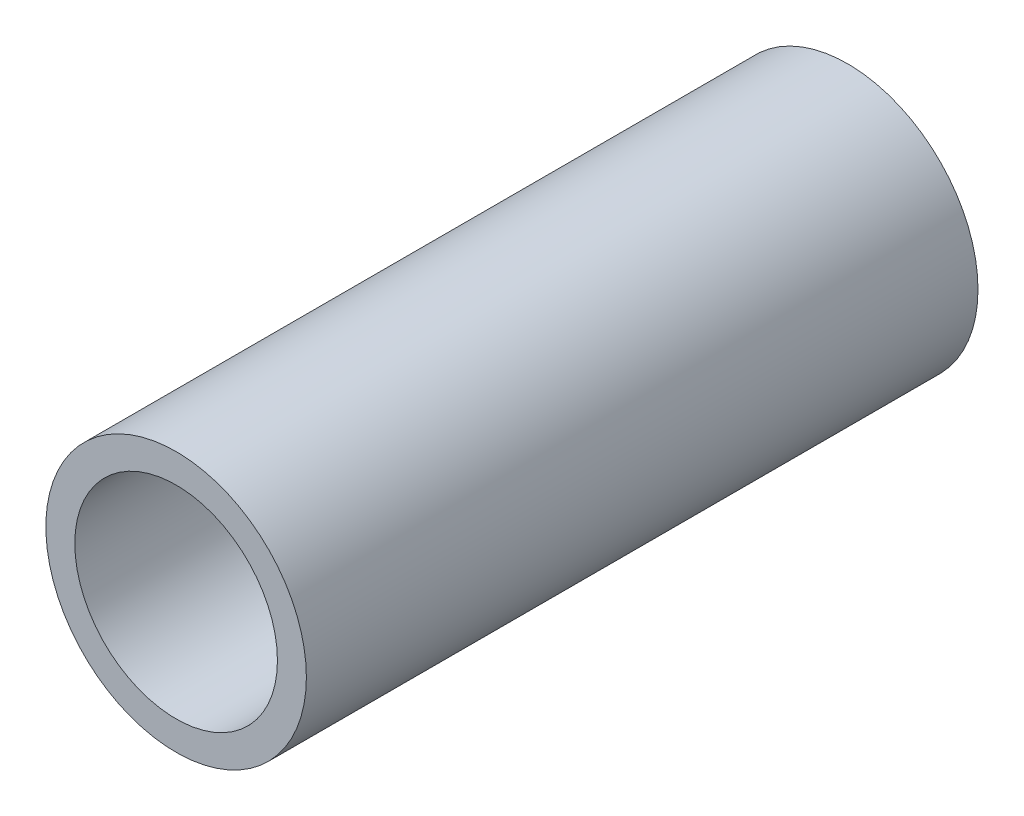
ISO-10303-21;
HEADER;
FILE_DESCRIPTION(('STEP AP214'),'2;1');
FILE_NAME('part.step','',(''),(''),'','','');
FILE_SCHEMA(('AUTOMOTIVE_DESIGN { 1 0 10303 214 1 1 1 1 }'));
ENDSEC;
DATA;
#1=APPLICATION_CONTEXT('core data for automotive mechanical design processes');
#2=APPLICATION_PROTOCOL_DEFINITION('international standard','automotive_design',2000,#1);
#3=PRODUCT_CONTEXT('',#1,'mechanical');
#4=PRODUCT('Part','Part','',(#3));
#5=PRODUCT_RELATED_PRODUCT_CATEGORY('part','',(#4));
#6=PRODUCT_DEFINITION_FORMATION('','',#4);
#7=PRODUCT_DEFINITION_CONTEXT('part definition',#1,'design');
#8=PRODUCT_DEFINITION('design','',#6,#7);
#9=PRODUCT_DEFINITION_SHAPE('','',#8);
#10=(LENGTH_UNIT() NAMED_UNIT(*) SI_UNIT(.MILLI.,.METRE.));
#11=(NAMED_UNIT(*) PLANE_ANGLE_UNIT() SI_UNIT($,.RADIAN.));
#12=(NAMED_UNIT(*) SI_UNIT($,.STERADIAN.) SOLID_ANGLE_UNIT());
#13=UNCERTAINTY_MEASURE_WITH_UNIT(LENGTH_MEASURE(1.E-05),#10,'distance_accuracy_value','');
#14=(GEOMETRIC_REPRESENTATION_CONTEXT(3) GLOBAL_UNCERTAINTY_ASSIGNED_CONTEXT((#13)) GLOBAL_UNIT_ASSIGNED_CONTEXT((#10,
#11,#12)) REPRESENTATION_CONTEXT('',''));
#15=CARTESIAN_POINT('',(0.,0.,0.));
#16=DIRECTION('',(0.,0.,1.));
#17=DIRECTION('',(1.,0.,0.));
#18=AXIS2_PLACEMENT_3D('',#15,#16,#17);
#19=CARTESIAN_POINT('',(0.,0.,29.));
#20=DIRECTION('',(0.,0.,1.));
#21=DIRECTION('',(1.,0.,0.));
#22=AXIS2_PLACEMENT_3D('',#19,#20,#21);
#23=PLANE('',#22);
#24=CARTESIAN_POINT('',(0.,0.,29.));
#25=DIRECTION('',(0.,0.,1.));
#26=DIRECTION('',(1.,0.,0.));
#27=AXIS2_PLACEMENT_3D('',#24,#25,#26);
#28=CIRCLE('',#27,5.625);
#29=CARTESIAN_POINT('',(5.625,0.,29.));
#30=VERTEX_POINT('',#29);
#31=EDGE_CURVE('E10',#30,#30,#28,.T.);
#32=ORIENTED_EDGE('',*,*,#31,.T.);
#33=EDGE_LOOP('',(#32));
#34=FACE_BOUND('',#33,.T.);
#35=CARTESIAN_POINT('',(0.,0.,29.));
#36=DIRECTION('',(0.,0.,1.));
#37=DIRECTION('',(1.,0.,0.));
#38=AXIS2_PLACEMENT_3D('',#35,#36,#37);
#39=CIRCLE('',#38,4.375);
#40=CARTESIAN_POINT('',(4.375,0.,29.));
#41=VERTEX_POINT('',#40);
#42=EDGE_CURVE('E40',#41,#41,#39,.T.);
#43=ORIENTED_EDGE('',*,*,#42,.F.);
#44=EDGE_LOOP('',(#43));
#45=FACE_BOUND('',#44,.T.);
#46=ADVANCED_FACE('F29',(#34,#45),#23,.T.);
#47=CARTESIAN_POINT('',(0.,0.,0.));
#48=DIRECTION('',(0.,0.,1.));
#49=DIRECTION('',(1.,0.,0.));
#50=AXIS2_PLACEMENT_3D('',#47,#48,#49);
#51=PLANE('',#50);
#52=CARTESIAN_POINT('',(0.,0.,0.));
#53=DIRECTION('',(0.,0.,1.));
#54=DIRECTION('',(1.,0.,0.));
#55=AXIS2_PLACEMENT_3D('',#52,#53,#54);
#56=CIRCLE('',#55,5.625);
#57=CARTESIAN_POINT('',(5.625,0.,0.));
#58=VERTEX_POINT('',#57);
#59=EDGE_CURVE('E33',#58,#58,#56,.T.);
#60=ORIENTED_EDGE('',*,*,#59,.F.);
#61=EDGE_LOOP('',(#60));
#62=FACE_BOUND('',#61,.T.);
#63=CARTESIAN_POINT('',(0.,0.,0.));
#64=DIRECTION('',(0.,0.,1.));
#65=DIRECTION('',(1.,0.,0.));
#66=AXIS2_PLACEMENT_3D('',#63,#64,#65);
#67=CIRCLE('',#66,4.375);
#68=CARTESIAN_POINT('',(4.375,0.,0.));
#69=VERTEX_POINT('',#68);
#70=EDGE_CURVE('E42',#69,#69,#67,.T.);
#71=ORIENTED_EDGE('',*,*,#70,.T.);
#72=EDGE_LOOP('',(#71));
#73=FACE_BOUND('',#72,.T.);
#74=ADVANCED_FACE('F52',(#62,#73),#51,.F.);
#75=CARTESIAN_POINT('',(0.,0.,29.));
#76=DIRECTION('',(0.,0.,-1.));
#77=DIRECTION('',(-1.,0.,0.));
#78=AXIS2_PLACEMENT_3D('',#75,#76,#77);
#79=CYLINDRICAL_SURFACE('',#78,5.625);
#80=ORIENTED_EDGE('',*,*,#31,.F.);
#81=EDGE_LOOP('',(#80));
#82=FACE_BOUND('',#81,.T.);
#83=ORIENTED_EDGE('',*,*,#59,.T.);
#84=EDGE_LOOP('',(#83));
#85=FACE_BOUND('',#84,.T.);
#86=ADVANCED_FACE('F31',(#82,#85),#79,.T.);
#87=CARTESIAN_POINT('',(0.,0.,29.));
#88=DIRECTION('',(0.,0.,-1.));
#89=DIRECTION('',(-1.,0.,0.));
#90=AXIS2_PLACEMENT_3D('',#87,#88,#89);
#91=CYLINDRICAL_SURFACE('',#90,4.375);
#92=ORIENTED_EDGE('',*,*,#42,.T.);
#93=EDGE_LOOP('',(#92));
#94=FACE_BOUND('',#93,.T.);
#95=ORIENTED_EDGE('',*,*,#70,.F.);
#96=EDGE_LOOP('',(#95));
#97=FACE_BOUND('',#96,.T.);
#98=ADVANCED_FACE('F48',(#94,#97),#91,.F.);
#99=CLOSED_SHELL('',(#46,#74,#86,#98));
#100=MANIFOLD_SOLID_BREP('B2',#99);
#101=ADVANCED_BREP_SHAPE_REPRESENTATION('',(#18,#100),#14);
#102=SHAPE_DEFINITION_REPRESENTATION(#9,#101);
ENDSEC;
END-ISO-10303-21;
